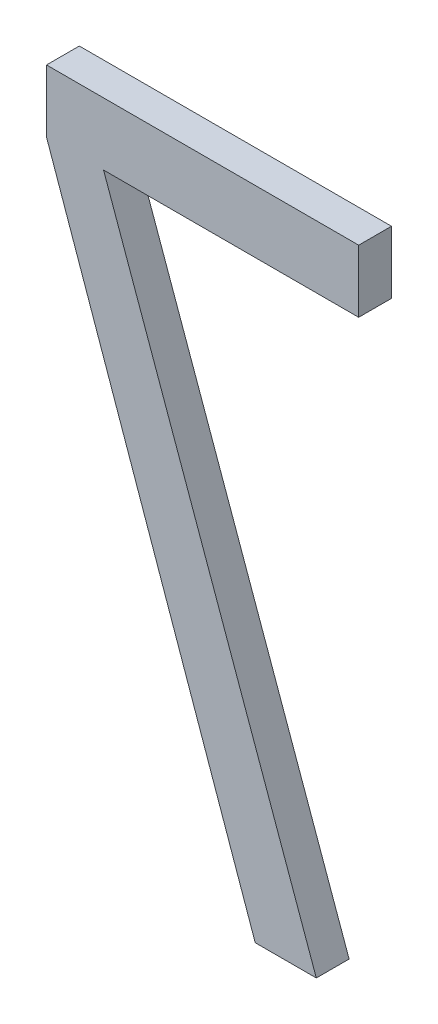
ISO-10303-21;
HEADER;
FILE_DESCRIPTION(('STEP AP214'),'2;1');
FILE_NAME('part.step','',(''),(''),'','','');
FILE_SCHEMA(('AUTOMOTIVE_DESIGN { 1 0 10303 214 1 1 1 1 }'));
ENDSEC;
DATA;
#1=APPLICATION_CONTEXT('core data for automotive mechanical design processes');
#2=APPLICATION_PROTOCOL_DEFINITION('international standard','automotive_design',2000,#1);
#3=PRODUCT_CONTEXT('',#1,'mechanical');
#4=PRODUCT('Part','Part','',(#3));
#5=PRODUCT_RELATED_PRODUCT_CATEGORY('part','',(#4));
#6=PRODUCT_DEFINITION_FORMATION('','',#4);
#7=PRODUCT_DEFINITION_CONTEXT('part definition',#1,'design');
#8=PRODUCT_DEFINITION('design','',#6,#7);
#9=PRODUCT_DEFINITION_SHAPE('','',#8);
#10=(LENGTH_UNIT() NAMED_UNIT(*) SI_UNIT(.MILLI.,.METRE.));
#11=(NAMED_UNIT(*) PLANE_ANGLE_UNIT() SI_UNIT($,.RADIAN.));
#12=(NAMED_UNIT(*) SI_UNIT($,.STERADIAN.) SOLID_ANGLE_UNIT());
#13=UNCERTAINTY_MEASURE_WITH_UNIT(LENGTH_MEASURE(1.E-05),#10,'distance_accuracy_value','');
#14=(GEOMETRIC_REPRESENTATION_CONTEXT(3) GLOBAL_UNCERTAINTY_ASSIGNED_CONTEXT((#13)) GLOBAL_UNIT_ASSIGNED_CONTEXT((#10,
#11,#12)) REPRESENTATION_CONTEXT('',''));
#15=CARTESIAN_POINT('',(0.,0.,0.));
#16=DIRECTION('',(0.,0.,1.));
#17=DIRECTION('',(1.,0.,0.));
#18=AXIS2_PLACEMENT_3D('',#15,#16,#17);
#19=CARTESIAN_POINT('',(180.653689823857,130.157011847241,-39.0997200126349));
#20=DIRECTION('',(0.,0.,-1.));
#21=DIRECTION('',(-1.,0.,0.));
#22=AXIS2_PLACEMENT_3D('',#19,#20,#21);
#23=PLANE('',#22);
#24=DIRECTION('',(-0.337556648697598,0.941305215602276,0.));
#25=VECTOR('',#24,1.);
#26=CARTESIAN_POINT('',(181.158192391769,129.252300359681,-39.0997200126349));
#27=LINE('',#26,#25);
#28=CARTESIAN_POINT('',(181.158192391769,129.252300359681,-39.0997200126349));
#29=VERTEX_POINT('',#28);
#30=CARTESIAN_POINT('',(180.509324473655,131.0617233348,-39.0997200126349));
#31=VERTEX_POINT('',#30);
#32=EDGE_CURVE('E104',#29,#31,#27,.T.);
#33=ORIENTED_EDGE('',*,*,#32,.F.);
#34=DIRECTION('',(1.,0.,0.));
#35=VECTOR('',#34,1.);
#36=CARTESIAN_POINT('',(180.97191452054,129.252300359681,-39.0997200126349));
#37=LINE('',#36,#35);
#38=CARTESIAN_POINT('',(180.97191452054,129.252300359681,-39.0997200126349));
#39=VERTEX_POINT('',#38);
#40=EDGE_CURVE('E108',#39,#29,#37,.T.);
#41=ORIENTED_EDGE('',*,*,#40,.F.);
#42=DIRECTION('',(0.331813690205463,-0.94334493955935,0.));
#43=VECTOR('',#42,1.);
#44=CARTESIAN_POINT('',(180.335465127174,131.0617233348,-39.0997200126349));
#45=LINE('',#44,#43);
#46=CARTESIAN_POINT('',(180.335465127174,131.0617233348,-39.0997200126349));
#47=VERTEX_POINT('',#46);
#48=EDGE_CURVE('E89',#47,#39,#45,.T.);
#49=ORIENTED_EDGE('',*,*,#48,.F.);
#50=DIRECTION('',(0.,1.,0.));
#51=VECTOR('',#50,1.);
#52=CARTESIAN_POINT('',(180.335465127174,131.252300359681,-39.0997200126349));
#53=LINE('',#52,#51);
#54=CARTESIAN_POINT('',(180.335465127174,131.252300359681,-39.0997200126349));
#55=VERTEX_POINT('',#54);
#56=EDGE_CURVE('E20',#55,#47,#53,.F.);
#57=ORIENTED_EDGE('',*,*,#56,.F.);
#58=DIRECTION('',(1.,0.,0.));
#59=VECTOR('',#58,1.);
#60=CARTESIAN_POINT('',(181.287422664934,131.252300359681,-39.0997200126349));
#61=LINE('',#60,#59);
#62=CARTESIAN_POINT('',(181.287422664934,131.252300359681,-39.0997200126349));
#63=VERTEX_POINT('',#62);
#64=EDGE_CURVE('E77',#63,#55,#61,.F.);
#65=ORIENTED_EDGE('',*,*,#64,.F.);
#66=DIRECTION('',(0.,1.,0.));
#67=VECTOR('',#66,1.);
#68=CARTESIAN_POINT('',(181.287422664934,131.0617233348,-39.0997200126349));
#69=LINE('',#68,#67);
#70=CARTESIAN_POINT('',(181.287422664934,131.0617233348,-39.0997200126349));
#71=VERTEX_POINT('',#70);
#72=EDGE_CURVE('E72',#71,#63,#69,.T.);
#73=ORIENTED_EDGE('',*,*,#72,.F.);
#74=DIRECTION('',(1.,0.,0.));
#75=VECTOR('',#74,1.);
#76=CARTESIAN_POINT('',(180.509324473655,131.0617233348,-39.0997200126349));
#77=LINE('',#76,#75);
#78=EDGE_CURVE('E100',#31,#71,#77,.T.);
#79=ORIENTED_EDGE('',*,*,#78,.F.);
#80=EDGE_LOOP('',(#33,#41,#49,#57,#65,#73,#79));
#81=FACE_BOUND('',#80,.T.);
#82=ADVANCED_FACE('F17',(#81),#23,.T.);
#83=CARTESIAN_POINT('',(180.335465127174,131.252300359681,-39.0997200126349));
#84=DIRECTION('',(-1.,0.,0.));
#85=DIRECTION('',(0.,0.,1.));
#86=AXIS2_PLACEMENT_3D('',#83,#84,#85);
#87=PLANE('',#86);
#88=ORIENTED_EDGE('',*,*,#56,.T.);
#89=DIRECTION('',(0.,0.,1.));
#90=VECTOR('',#89,1.);
#91=CARTESIAN_POINT('',(180.335465127174,131.0617233348,-39.0997200126349));
#92=LINE('',#91,#90);
#93=CARTESIAN_POINT('',(180.335465127174,131.0617233348,-38.9997200126349));
#94=VERTEX_POINT('',#93);
#95=EDGE_CURVE('E112',#94,#47,#92,.F.);
#96=ORIENTED_EDGE('',*,*,#95,.F.);
#97=DIRECTION('',(0.,1.,0.));
#98=VECTOR('',#97,1.);
#99=CARTESIAN_POINT('',(180.335465127174,130.157011847241,-38.9997200126349));
#100=LINE('',#99,#98);
#101=CARTESIAN_POINT('',(180.335465127174,131.252300359681,-38.9997200126349));
#102=VERTEX_POINT('',#101);
#103=EDGE_CURVE('E95',#94,#102,#100,.T.);
#104=ORIENTED_EDGE('',*,*,#103,.T.);
#105=DIRECTION('',(0.,0.,1.));
#106=VECTOR('',#105,1.);
#107=CARTESIAN_POINT('',(180.335465127174,131.252300359681,-39.0997200126349));
#108=LINE('',#107,#106);
#109=EDGE_CURVE('E82',#55,#102,#108,.T.);
#110=ORIENTED_EDGE('',*,*,#109,.F.);
#111=EDGE_LOOP('',(#88,#96,#104,#110));
#112=FACE_BOUND('',#111,.T.);
#113=ADVANCED_FACE('F94',(#112),#87,.T.);
#114=CARTESIAN_POINT('',(181.287422664934,131.252300359681,-39.0997200126349));
#115=DIRECTION('',(0.,1.,0.));
#116=DIRECTION('',(0.,0.,1.));
#117=AXIS2_PLACEMENT_3D('',#114,#115,#116);
#118=PLANE('',#117);
#119=ORIENTED_EDGE('',*,*,#64,.T.);
#120=ORIENTED_EDGE('',*,*,#109,.T.);
#121=DIRECTION('',(-1.,0.,0.));
#122=VECTOR('',#121,1.);
#123=CARTESIAN_POINT('',(180.653689823857,131.252300359681,-38.9997200126349));
#124=LINE('',#123,#122);
#125=CARTESIAN_POINT('',(181.287422664934,131.252300359681,-38.9997200126349));
#126=VERTEX_POINT('',#125);
#127=EDGE_CURVE('E117',#102,#126,#124,.F.);
#128=ORIENTED_EDGE('',*,*,#127,.T.);
#129=DIRECTION('',(0.,0.,-1.));
#130=VECTOR('',#129,1.);
#131=CARTESIAN_POINT('',(181.287422664934,131.252300359681,-39.0997200126349));
#132=LINE('',#131,#130);
#133=EDGE_CURVE('E84',#63,#126,#132,.F.);
#134=ORIENTED_EDGE('',*,*,#133,.F.);
#135=EDGE_LOOP('',(#119,#120,#128,#134));
#136=FACE_BOUND('',#135,.T.);
#137=ADVANCED_FACE('F79',(#136),#118,.T.);
#138=CARTESIAN_POINT('',(181.287422664934,131.0617233348,-39.0997200126349));
#139=DIRECTION('',(1.,0.,0.));
#140=DIRECTION('',(0.,0.,-1.));
#141=AXIS2_PLACEMENT_3D('',#138,#139,#140);
#142=PLANE('',#141);
#143=ORIENTED_EDGE('',*,*,#72,.T.);
#144=ORIENTED_EDGE('',*,*,#133,.T.);
#145=DIRECTION('',(0.,1.,0.));
#146=VECTOR('',#145,1.);
#147=CARTESIAN_POINT('',(181.287422664934,130.157011847241,-38.9997200126349));
#148=LINE('',#147,#146);
#149=CARTESIAN_POINT('',(181.287422664934,131.0617233348,-38.9997200126349));
#150=VERTEX_POINT('',#149);
#151=EDGE_CURVE('E119',#126,#150,#148,.F.);
#152=ORIENTED_EDGE('',*,*,#151,.T.);
#153=DIRECTION('',(0.,0.,-1.));
#154=VECTOR('',#153,1.);
#155=CARTESIAN_POINT('',(181.287422664934,131.0617233348,-39.0997200126349));
#156=LINE('',#155,#154);
#157=EDGE_CURVE('E102',#71,#150,#156,.F.);
#158=ORIENTED_EDGE('',*,*,#157,.F.);
#159=EDGE_LOOP('',(#143,#144,#152,#158));
#160=FACE_BOUND('',#159,.T.);
#161=ADVANCED_FACE('F144',(#160),#142,.T.);
#162=CARTESIAN_POINT('',(180.509324473655,131.0617233348,-39.0997200126349));
#163=DIRECTION('',(0.,-1.,0.));
#164=DIRECTION('',(0.,0.,-1.));
#165=AXIS2_PLACEMENT_3D('',#162,#163,#164);
#166=PLANE('',#165);
#167=ORIENTED_EDGE('',*,*,#78,.T.);
#168=ORIENTED_EDGE('',*,*,#157,.T.);
#169=DIRECTION('',(-1.,0.,0.));
#170=VECTOR('',#169,1.);
#171=CARTESIAN_POINT('',(180.653689823857,131.0617233348,-38.9997200126349));
#172=LINE('',#171,#170);
#173=CARTESIAN_POINT('',(180.509324473655,131.0617233348,-38.9997200126349));
#174=VERTEX_POINT('',#173);
#175=EDGE_CURVE('E122',#150,#174,#172,.T.);
#176=ORIENTED_EDGE('',*,*,#175,.T.);
#177=DIRECTION('',(0.,0.,1.));
#178=VECTOR('',#177,1.);
#179=CARTESIAN_POINT('',(180.509324473655,131.061723334801,-39.0997200126349));
#180=LINE('',#179,#178);
#181=EDGE_CURVE('E106',#31,#174,#180,.T.);
#182=ORIENTED_EDGE('',*,*,#181,.F.);
#183=EDGE_LOOP('',(#167,#168,#176,#182));
#184=FACE_BOUND('',#183,.T.);
#185=ADVANCED_FACE('F142',(#184),#166,.T.);
#186=CARTESIAN_POINT('',(181.158192391769,129.252300359681,-39.0997200126349));
#187=DIRECTION('',(0.941305215602276,0.337556648697598,0.));
#188=DIRECTION('',(-0.337556648697598,0.941305215602276,0.));
#189=AXIS2_PLACEMENT_3D('',#186,#187,#188);
#190=PLANE('',#189);
#191=ORIENTED_EDGE('',*,*,#32,.T.);
#192=ORIENTED_EDGE('',*,*,#181,.T.);
#193=DIRECTION('',(0.337556648697638,-0.941305215602261,0.));
#194=VECTOR('',#193,1.);
#195=CARTESIAN_POINT('',(180.509324473655,131.0617233348,-38.9997200126349));
#196=LINE('',#195,#194);
#197=CARTESIAN_POINT('',(181.158192391769,129.252300359681,-38.9997200126349));
#198=VERTEX_POINT('',#197);
#199=EDGE_CURVE('E125',#174,#198,#196,.T.);
#200=ORIENTED_EDGE('',*,*,#199,.T.);
#201=DIRECTION('',(0.,0.,-1.));
#202=VECTOR('',#201,1.);
#203=CARTESIAN_POINT('',(181.158192391769,129.252300359681,-39.0997200126349));
#204=LINE('',#203,#202);
#205=EDGE_CURVE('E110',#29,#198,#204,.F.);
#206=ORIENTED_EDGE('',*,*,#205,.F.);
#207=EDGE_LOOP('',(#191,#192,#200,#206));
#208=FACE_BOUND('',#207,.T.);
#209=ADVANCED_FACE('F138',(#208),#190,.T.);
#210=CARTESIAN_POINT('',(180.97191452054,129.252300359681,-39.0997200126349));
#211=DIRECTION('',(0.,-1.,0.));
#212=DIRECTION('',(0.,0.,-1.));
#213=AXIS2_PLACEMENT_3D('',#210,#211,#212);
#214=PLANE('',#213);
#215=ORIENTED_EDGE('',*,*,#40,.T.);
#216=ORIENTED_EDGE('',*,*,#205,.T.);
#217=DIRECTION('',(-1.,0.,0.));
#218=VECTOR('',#217,1.);
#219=CARTESIAN_POINT('',(180.653689823857,129.252300359681,-38.9997200126349));
#220=LINE('',#219,#218);
#221=CARTESIAN_POINT('',(180.97191452054,129.252300359681,-38.9997200126349));
#222=VERTEX_POINT('',#221);
#223=EDGE_CURVE('E26',#198,#222,#220,.T.);
#224=ORIENTED_EDGE('',*,*,#223,.T.);
#225=DIRECTION('',(0.,0.,1.));
#226=VECTOR('',#225,1.);
#227=CARTESIAN_POINT('',(180.97191452054,129.252300359681,-39.0997200126349));
#228=LINE('',#227,#226);
#229=EDGE_CURVE('E34',#39,#222,#228,.T.);
#230=ORIENTED_EDGE('',*,*,#229,.F.);
#231=EDGE_LOOP('',(#215,#216,#224,#230));
#232=FACE_BOUND('',#231,.T.);
#233=ADVANCED_FACE('F131',(#232),#214,.T.);
#234=CARTESIAN_POINT('',(180.335465127174,131.0617233348,-39.0997200126349));
#235=DIRECTION('',(-0.94334493955935,-0.331813690205463,0.));
#236=DIRECTION('',(0.331813690205463,-0.94334493955935,0.));
#237=AXIS2_PLACEMENT_3D('',#234,#235,#236);
#238=PLANE('',#237);
#239=ORIENTED_EDGE('',*,*,#48,.T.);
#240=ORIENTED_EDGE('',*,*,#229,.T.);
#241=DIRECTION('',(-0.331813690205491,0.94334493955934,0.));
#242=VECTOR('',#241,1.);
#243=CARTESIAN_POINT('',(180.97191452054,129.252300359681,-38.9997200126349));
#244=LINE('',#243,#242);
#245=EDGE_CURVE('E11',#222,#94,#244,.T.);
#246=ORIENTED_EDGE('',*,*,#245,.T.);
#247=ORIENTED_EDGE('',*,*,#95,.T.);
#248=EDGE_LOOP('',(#239,#240,#246,#247));
#249=FACE_BOUND('',#248,.T.);
#250=ADVANCED_FACE('F155',(#249),#238,.T.);
#251=CARTESIAN_POINT('',(180.653689823857,130.157011847241,-38.9997200126349));
#252=DIRECTION('',(0.,0.,-1.));
#253=DIRECTION('',(-1.,0.,0.));
#254=AXIS2_PLACEMENT_3D('',#251,#252,#253);
#255=PLANE('',#254);
#256=ORIENTED_EDGE('',*,*,#223,.F.);
#257=ORIENTED_EDGE('',*,*,#199,.F.);
#258=ORIENTED_EDGE('',*,*,#175,.F.);
#259=ORIENTED_EDGE('',*,*,#151,.F.);
#260=ORIENTED_EDGE('',*,*,#127,.F.);
#261=ORIENTED_EDGE('',*,*,#103,.F.);
#262=ORIENTED_EDGE('',*,*,#245,.F.);
#263=EDGE_LOOP('',(#256,#257,#258,#259,#260,#261,#262));
#264=FACE_BOUND('',#263,.T.);
#265=ADVANCED_FACE('F135',(#264),#255,.F.);
#266=CLOSED_SHELL('',(#82,#113,#137,#161,#185,#209,#233,#250,#265));
#267=MANIFOLD_SOLID_BREP('B1',#266);
#268=ADVANCED_BREP_SHAPE_REPRESENTATION('',(#18,#267),#14);
#269=SHAPE_DEFINITION_REPRESENTATION(#9,#268);
ENDSEC;
END-ISO-10303-21;
